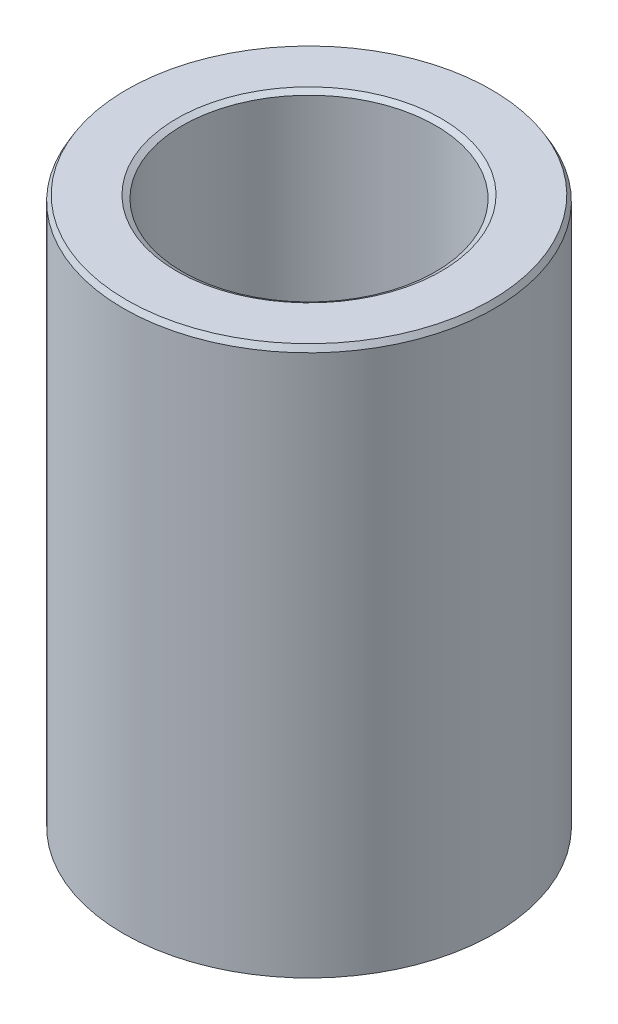
ISO-10303-21;
HEADER;
FILE_DESCRIPTION(('STEP AP214'),'2;1');
FILE_NAME('part.step','',(''),(''),'','','');
FILE_SCHEMA(('AUTOMOTIVE_DESIGN { 1 0 10303 214 1 1 1 1 }'));
ENDSEC;
DATA;
#1=APPLICATION_CONTEXT('core data for automotive mechanical design processes');
#2=APPLICATION_PROTOCOL_DEFINITION('international standard','automotive_design',2000,#1);
#3=PRODUCT_CONTEXT('',#1,'mechanical');
#4=PRODUCT('Part','Part','',(#3));
#5=PRODUCT_RELATED_PRODUCT_CATEGORY('part','',(#4));
#6=PRODUCT_DEFINITION_FORMATION('','',#4);
#7=PRODUCT_DEFINITION_CONTEXT('part definition',#1,'design');
#8=PRODUCT_DEFINITION('design','',#6,#7);
#9=PRODUCT_DEFINITION_SHAPE('','',#8);
#10=(LENGTH_UNIT() NAMED_UNIT(*) SI_UNIT(.MILLI.,.METRE.));
#11=(NAMED_UNIT(*) PLANE_ANGLE_UNIT() SI_UNIT($,.RADIAN.));
#12=(NAMED_UNIT(*) SI_UNIT($,.STERADIAN.) SOLID_ANGLE_UNIT());
#13=UNCERTAINTY_MEASURE_WITH_UNIT(LENGTH_MEASURE(1.E-05),#10,'distance_accuracy_value','');
#14=(GEOMETRIC_REPRESENTATION_CONTEXT(3) GLOBAL_UNCERTAINTY_ASSIGNED_CONTEXT((#13)) GLOBAL_UNIT_ASSIGNED_CONTEXT((#10,
#11,#12)) REPRESENTATION_CONTEXT('',''));
#15=CARTESIAN_POINT('',(0.,0.,0.));
#16=DIRECTION('',(0.,0.,1.));
#17=DIRECTION('',(1.,0.,0.));
#18=AXIS2_PLACEMENT_3D('',#15,#16,#17);
#19=CARTESIAN_POINT('',(0.,155.70058295993,0.));
#20=DIRECTION('',(0.,-1.,0.));
#21=DIRECTION('',(0.,0.,-1.));
#22=AXIS2_PLACEMENT_3D('',#19,#20,#21);
#23=CYLINDRICAL_SURFACE('',#22,52.5);
#24=CARTESIAN_POINT('',(0.,0.919931123638945,0.));
#25=DIRECTION('',(0.,1.,0.));
#26=DIRECTION('',(0.,0.,1.));
#27=AXIS2_PLACEMENT_3D('',#24,#25,#26);
#28=CIRCLE('',#27,52.5);
#29=CARTESIAN_POINT('',(0.,0.919931123638945,52.5));
#30=VERTEX_POINT('',#29);
#31=EDGE_CURVE('E10',#30,#30,#28,.T.);
#32=ORIENTED_EDGE('',*,*,#31,.T.);
#33=EDGE_LOOP('',(#32));
#34=FACE_BOUND('',#33,.T.);
#35=CARTESIAN_POINT('',(0.,154.107215514323,0.));
#36=DIRECTION('',(0.,1.,0.));
#37=DIRECTION('',(0.,0.,1.));
#38=AXIS2_PLACEMENT_3D('',#35,#36,#37);
#39=CIRCLE('',#38,52.5);
#40=CARTESIAN_POINT('',(0.,154.107215514323,52.5));
#41=VERTEX_POINT('',#40);
#42=EDGE_CURVE('E50',#41,#41,#39,.F.);
#43=ORIENTED_EDGE('',*,*,#42,.T.);
#44=EDGE_LOOP('',(#43));
#45=FACE_BOUND('',#44,.T.);
#46=ADVANCED_FACE('F39',(#34,#45),#23,.T.);
#47=CARTESIAN_POINT('',(0.,155.70058295993,0.));
#48=DIRECTION('',(0.,1.,0.));
#49=DIRECTION('',(0.,0.,1.));
#50=AXIS2_PLACEMENT_3D('',#47,#48,#49);
#51=PLANE('',#50);
#52=CARTESIAN_POINT('',(0.,155.70058295993,0.));
#53=DIRECTION('',(0.,1.,0.));
#54=DIRECTION('',(0.,0.,1.));
#55=AXIS2_PLACEMENT_3D('',#52,#53,#54);
#56=CIRCLE('',#55,37.4243251456033);
#57=CARTESIAN_POINT('',(0.,155.70058295993,37.4243251456033));
#58=VERTEX_POINT('',#57);
#59=EDGE_CURVE('E58',#58,#58,#56,.F.);
#60=ORIENTED_EDGE('',*,*,#59,.T.);
#61=EDGE_LOOP('',(#60));
#62=FACE_BOUND('',#61,.T.);
#63=CARTESIAN_POINT('',(0.,155.70058295993,0.));
#64=DIRECTION('',(0.,1.,0.));
#65=DIRECTION('',(0.,0.,1.));
#66=AXIS2_PLACEMENT_3D('',#63,#64,#65);
#67=CIRCLE('',#66,51.5800688763611);
#68=CARTESIAN_POINT('',(0.,155.70058295993,51.5800688763611));
#69=VERTEX_POINT('',#68);
#70=EDGE_CURVE('E61',#69,#69,#67,.T.);
#71=ORIENTED_EDGE('',*,*,#70,.T.);
#72=EDGE_LOOP('',(#71));
#73=FACE_BOUND('',#72,.T.);
#74=ADVANCED_FACE('F88',(#62,#73),#51,.T.);
#75=CARTESIAN_POINT('',(0.,0.,0.));
#76=DIRECTION('',(0.,1.,0.));
#77=DIRECTION('',(0.,0.,1.));
#78=AXIS2_PLACEMENT_3D('',#75,#76,#77);
#79=PLANE('',#78);
#80=CARTESIAN_POINT('',(0.,0.,0.));
#81=DIRECTION('',(0.,1.,0.));
#82=DIRECTION('',(0.,0.,1.));
#83=AXIS2_PLACEMENT_3D('',#80,#81,#82);
#84=CIRCLE('',#83,36.7508888236356);
#85=CARTESIAN_POINT('',(0.,0.,36.7508888236356));
#86=VERTEX_POINT('',#85);
#87=EDGE_CURVE('E51',#86,#86,#84,.T.);
#88=ORIENTED_EDGE('',*,*,#87,.T.);
#89=EDGE_LOOP('',(#88));
#90=FACE_BOUND('',#89,.T.);
#91=CARTESIAN_POINT('',(0.,0.,0.));
#92=DIRECTION('',(0.,1.,0.));
#93=DIRECTION('',(0.,0.,1.));
#94=AXIS2_PLACEMENT_3D('',#91,#92,#93);
#95=CIRCLE('',#94,50.9066325543934);
#96=CARTESIAN_POINT('',(0.,0.,50.9066325543934));
#97=VERTEX_POINT('',#96);
#98=EDGE_CURVE('E54',#97,#97,#95,.F.);
#99=ORIENTED_EDGE('',*,*,#98,.T.);
#100=EDGE_LOOP('',(#99));
#101=FACE_BOUND('',#100,.T.);
#102=ADVANCED_FACE('F83',(#90,#101),#79,.F.);
#103=CARTESIAN_POINT('',(0.,155.70058295993,0.));
#104=DIRECTION('',(0.,-1.,0.));
#105=DIRECTION('',(0.,0.,-1.));
#106=AXIS2_PLACEMENT_3D('',#103,#104,#105);
#107=CYLINDRICAL_SURFACE('',#106,35.8309576999967);
#108=CARTESIAN_POINT('',(0.,154.780651836291,0.));
#109=DIRECTION('',(0.,1.,0.));
#110=DIRECTION('',(0.,0.,1.));
#111=AXIS2_PLACEMENT_3D('',#108,#109,#110);
#112=CIRCLE('',#111,35.8309576999967);
#113=CARTESIAN_POINT('',(0.,154.780651836291,35.8309576999967));
#114=VERTEX_POINT('',#113);
#115=EDGE_CURVE('E67',#114,#114,#112,.T.);
#116=ORIENTED_EDGE('',*,*,#115,.T.);
#117=EDGE_LOOP('',(#116));
#118=FACE_BOUND('',#117,.T.);
#119=CARTESIAN_POINT('',(0.,1.59336744560659,0.));
#120=DIRECTION('',(0.,1.,0.));
#121=DIRECTION('',(0.,0.,1.));
#122=AXIS2_PLACEMENT_3D('',#119,#120,#121);
#123=CIRCLE('',#122,35.8309576999967);
#124=CARTESIAN_POINT('',(0.,1.59336744560659,35.8309576999967));
#125=VERTEX_POINT('',#124);
#126=EDGE_CURVE('E69',#125,#125,#123,.F.);
#127=ORIENTED_EDGE('',*,*,#126,.T.);
#128=EDGE_LOOP('',(#127));
#129=FACE_BOUND('',#128,.T.);
#130=ADVANCED_FACE('F71',(#118,#129),#107,.F.);
#131=CARTESIAN_POINT('',(0.,154.780651836291,0.));
#132=DIRECTION('',(0.,1.,0.));
#133=DIRECTION('',(0.,0.,1.));
#134=AXIS2_PLACEMENT_3D('',#131,#132,#133);
#135=CONICAL_SURFACE('',#134,35.8309576999967,1.0471975511966);
#136=CARTESIAN_POINT('',(0.,155.70058295993,37.4243251456033));
#137=CARTESIAN_POINT('',(0.,155.691000344059,37.4077275680449));
#138=CARTESIAN_POINT('',(0.,155.681417728187,37.3911299904865));
#139=CARTESIAN_POINT('',(0.,155.662252496445,37.3579348353697));
#140=CARTESIAN_POINT('',(0.,155.652669880574,37.3413372578113));
#141=CARTESIAN_POINT('',(0.,155.633504648831,37.3081421026945));
#142=CARTESIAN_POINT('',(0.,155.62392203296,37.2915445251361));
#143=CARTESIAN_POINT('',(0.,155.604756801217,37.2583493700193));
#144=CARTESIAN_POINT('',(0.,155.595174185346,37.2417517924609));
#145=CARTESIAN_POINT('',(0.,155.576008953604,37.2085566373441));
#146=CARTESIAN_POINT('',(0.,155.566426337732,37.1919590597857));
#147=CARTESIAN_POINT('',(0.,155.54726110599,37.1587639046689));
#148=CARTESIAN_POINT('',(0.,155.537678490119,37.1421663271105));
#149=CARTESIAN_POINT('',(0.,155.518513258376,37.1089711719936));
#150=CARTESIAN_POINT('',(0.,155.508930642505,37.0923735944353));
#151=CARTESIAN_POINT('',(0.,155.489765410762,37.0591784393184));
#152=CARTESIAN_POINT('',(0.,155.480182794891,37.04258086176));
#153=CARTESIAN_POINT('',(0.,155.461017563149,37.0093857066432));
#154=CARTESIAN_POINT('',(0.,155.451434947278,36.9927881290848));
#155=CARTESIAN_POINT('',(0.,155.432269715535,36.959592973968));
#156=CARTESIAN_POINT('',(0.,155.422687099664,36.9429953964096));
#157=CARTESIAN_POINT('',(0.,155.403521867921,36.9098002412928));
#158=CARTESIAN_POINT('',(0.,155.39393925205,36.8932026637344));
#159=CARTESIAN_POINT('',(0.,155.374774020308,36.8600075086176));
#160=CARTESIAN_POINT('',(0.,155.365191404436,36.8434099310592));
#161=CARTESIAN_POINT('',(0.,155.346026172694,36.8102147759424));
#162=CARTESIAN_POINT('',(0.,155.336443556823,36.793617198384));
#163=CARTESIAN_POINT('',(0.,155.31727832508,36.7604220432672));
#164=CARTESIAN_POINT('',(0.,155.307695709209,36.7438244657088));
#165=CARTESIAN_POINT('',(0.,155.288530477466,36.710629310592));
#166=CARTESIAN_POINT('',(0.,155.278947861595,36.6940317330336));
#167=CARTESIAN_POINT('',(0.,155.259782629853,36.6608365779168));
#168=CARTESIAN_POINT('',(0.,155.250200013981,36.6442390003584));
#169=CARTESIAN_POINT('',(0.,155.231034782239,36.6110438452416));
#170=CARTESIAN_POINT('',(0.,155.221452166368,36.5944462676832));
#171=CARTESIAN_POINT('',(0.,155.202286934625,36.5612511125664));
#172=CARTESIAN_POINT('',(0.,155.192704318754,36.544653535008));
#173=CARTESIAN_POINT('',(0.,155.173539087012,36.5114583798912));
#174=CARTESIAN_POINT('',(0.,155.16395647114,36.4948608023328));
#175=CARTESIAN_POINT('',(0.,155.144791239398,36.461665647216));
#176=CARTESIAN_POINT('',(0.,155.135208623527,36.4450680696576));
#177=CARTESIAN_POINT('',(0.,155.116043391784,36.4118729145408));
#178=CARTESIAN_POINT('',(0.,155.106460775913,36.3952753369824));
#179=CARTESIAN_POINT('',(0.,155.08729554417,36.3620801818655));
#180=CARTESIAN_POINT('',(0.,155.077712928299,36.3454826043071));
#181=CARTESIAN_POINT('',(0.,155.058547696557,36.3122874491903));
#182=CARTESIAN_POINT('',(0.,155.048965080685,36.2956898716319));
#183=CARTESIAN_POINT('',(0.,155.029799848943,36.2624947165151));
#184=CARTESIAN_POINT('',(0.,155.020217233072,36.2458971389567));
#185=CARTESIAN_POINT('',(0.,155.001052001329,36.2127019838399));
#186=CARTESIAN_POINT('',(0.,154.991469385458,36.1961044062815));
#187=CARTESIAN_POINT('',(0.,154.972304153716,36.1629092511647));
#188=CARTESIAN_POINT('',(0.,154.962721537844,36.1463116736063));
#189=CARTESIAN_POINT('',(0.,154.943556306102,36.1131165184895));
#190=CARTESIAN_POINT('',(0.,154.933973690231,36.0965189409311));
#191=CARTESIAN_POINT('',(0.,154.914808458488,36.0633237858143));
#192=CARTESIAN_POINT('',(0.,154.905225842617,36.0467262082559));
#193=CARTESIAN_POINT('',(0.,154.886060610874,36.0135310531391));
#194=CARTESIAN_POINT('',(0.,154.876477995003,35.9969334755807));
#195=CARTESIAN_POINT('',(0.,154.857312763261,35.9637383204639));
#196=CARTESIAN_POINT('',(0.,154.847730147389,35.9471407429055));
#197=CARTESIAN_POINT('',(0.,154.828564915647,35.9139455877887));
#198=CARTESIAN_POINT('',(0.,154.818982299776,35.8973480102303));
#199=CARTESIAN_POINT('',(0.,154.799817068033,35.8641528551135));
#200=CARTESIAN_POINT('',(0.,154.790234452162,35.8475552775551));
#201=CARTESIAN_POINT('',(0.,154.780651836291,35.8309576999967));
#202=B_SPLINE_CURVE_WITH_KNOTS('',3,(#136,#137,#138,#139,#140,#141,#142,#143,#144,#145,#146,
#147,#148,#149,#150,#151,#152,#153,#154,#155,#156,#157,#158,#159,#160,#161,#162,#163,#164,#165,
#166,#167,#168,#169,#170,#171,#172,#173,#174,#175,#176,#177,#178,#179,#180,#181,#182,#183,#184,
#185,#186,#187,#188,#189,#190,#191,#192,#193,#194,#195,#196,#197,#198,#199,#200,#201),
.UNSPECIFIED.,.F.,.F.,(4,2,2,2,2,2,2,2,2,2,2,2,2,2,2,2,2,2,2,2,2,2,2,2,2,2,2,2,2,2,2,2,4),(0.,
0.0574956952274297,0.114991390454867,0.172487085682305,0.229982780909742,0.287478476137172,
0.34497417136461,0.402469866592047,0.459965561819485,0.517461257046914,0.574956952274352,
0.632452647501789,0.689948342729227,0.747444037956657,0.804939733184094,0.862435428411532,
0.919931123638969,0.977426818866399,1.03492251409384,1.09241820932127,1.14991390454871,
1.20740959977614,1.26490529500358,1.32240099023102,1.37989668545845,1.43739238068588,
1.49488807591332,1.55238377114076,1.6098794663682,1.66737516159563,1.72487085682306,
1.7823665520505,1.83986224727792),.UNSPECIFIED.);
#203=EDGE_CURVE('BSEAM77',#58,#114,#202,.T.);
#204=ORIENTED_EDGE('',*,*,#59,.F.);
#205=ORIENTED_EDGE('',*,*,#115,.F.);
#206=ORIENTED_EDGE('',*,*,#203,.T.);
#207=ORIENTED_EDGE('',*,*,#203,.F.);
#208=EDGE_LOOP('',(#204,#206,#205,#207));
#209=FACE_BOUND('',#208,.T.);
#210=ADVANCED_FACE('F77',(#209),#135,.F.);
#211=CARTESIAN_POINT('',(0.,0.,0.));
#212=DIRECTION('',(0.,-1.,0.));
#213=DIRECTION('',(0.,0.,-1.));
#214=AXIS2_PLACEMENT_3D('',#211,#212,#213);
#215=CONICAL_SURFACE('',#214,36.7508888236356,0.523598775598296);
#216=ORIENTED_EDGE('',*,*,#126,.F.);
#217=EDGE_LOOP('',(#216));
#218=FACE_BOUND('',#217,.T.);
#219=ORIENTED_EDGE('',*,*,#87,.F.);
#220=EDGE_LOOP('',(#219));
#221=FACE_BOUND('',#220,.T.);
#222=ADVANCED_FACE('F73',(#218,#221),#215,.F.);
#223=CARTESIAN_POINT('',(0.,0.919931123638945,0.));
#224=DIRECTION('',(0.,1.,0.));
#225=DIRECTION('',(0.,0.,1.));
#226=AXIS2_PLACEMENT_3D('',#223,#224,#225);
#227=CONICAL_SURFACE('',#226,52.5,1.0471975511966);
#228=ORIENTED_EDGE('',*,*,#98,.F.);
#229=EDGE_LOOP('',(#228));
#230=FACE_BOUND('',#229,.T.);
#231=ORIENTED_EDGE('',*,*,#31,.F.);
#232=EDGE_LOOP('',(#231));
#233=FACE_BOUND('',#232,.T.);
#234=ADVANCED_FACE('F76',(#230,#233),#227,.T.);
#235=CARTESIAN_POINT('',(0.,155.70058295993,0.));
#236=DIRECTION('',(0.,-1.,0.));
#237=DIRECTION('',(0.,0.,-1.));
#238=AXIS2_PLACEMENT_3D('',#235,#236,#237);
#239=CONICAL_SURFACE('',#238,51.5800688763611,0.523598775598285);
#240=ORIENTED_EDGE('',*,*,#42,.F.);
#241=EDGE_LOOP('',(#240));
#242=FACE_BOUND('',#241,.T.);
#243=ORIENTED_EDGE('',*,*,#70,.F.);
#244=EDGE_LOOP('',(#243));
#245=FACE_BOUND('',#244,.T.);
#246=ADVANCED_FACE('F45',(#242,#245),#239,.T.);
#247=CLOSED_SHELL('',(#46,#74,#102,#130,#210,#222,#234,#246));
#248=MANIFOLD_SOLID_BREP('B2',#247);
#249=ADVANCED_BREP_SHAPE_REPRESENTATION('',(#18,#248),#14);
#250=SHAPE_DEFINITION_REPRESENTATION(#9,#249);
ENDSEC;
END-ISO-10303-21;
